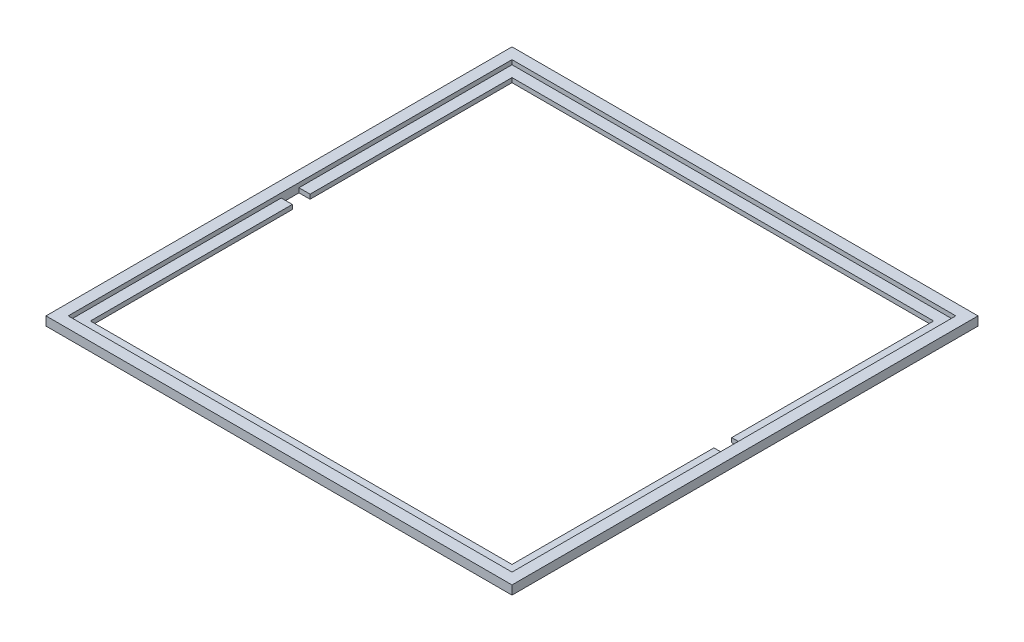
ISO-10303-21;
HEADER;
FILE_DESCRIPTION(('STEP AP214'),'2;1');
FILE_NAME('part.step','',(''),(''),'','','');
FILE_SCHEMA(('AUTOMOTIVE_DESIGN { 1 0 10303 214 1 1 1 1 }'));
ENDSEC;
DATA;
#1=APPLICATION_CONTEXT('core data for automotive mechanical design processes');
#2=APPLICATION_PROTOCOL_DEFINITION('international standard','automotive_design',2000,#1);
#3=PRODUCT_CONTEXT('',#1,'mechanical');
#4=PRODUCT('Part','Part','',(#3));
#5=PRODUCT_RELATED_PRODUCT_CATEGORY('part','',(#4));
#6=PRODUCT_DEFINITION_FORMATION('','',#4);
#7=PRODUCT_DEFINITION_CONTEXT('part definition',#1,'design');
#8=PRODUCT_DEFINITION('design','',#6,#7);
#9=PRODUCT_DEFINITION_SHAPE('','',#8);
#10=(LENGTH_UNIT() NAMED_UNIT(*) SI_UNIT(.MILLI.,.METRE.));
#11=(NAMED_UNIT(*) PLANE_ANGLE_UNIT() SI_UNIT($,.RADIAN.));
#12=(NAMED_UNIT(*) SI_UNIT($,.STERADIAN.) SOLID_ANGLE_UNIT());
#13=UNCERTAINTY_MEASURE_WITH_UNIT(LENGTH_MEASURE(1.E-05),#10,'distance_accuracy_value','');
#14=(GEOMETRIC_REPRESENTATION_CONTEXT(3) GLOBAL_UNCERTAINTY_ASSIGNED_CONTEXT((#13)) GLOBAL_UNIT_ASSIGNED_CONTEXT((#10,
#11,#12)) REPRESENTATION_CONTEXT('',''));
#15=CARTESIAN_POINT('',(0.,0.,0.));
#16=DIRECTION('',(0.,0.,1.));
#17=DIRECTION('',(1.,0.,0.));
#18=AXIS2_PLACEMENT_3D('',#15,#16,#17);
#19=CARTESIAN_POINT('',(0.,2.,0.));
#20=DIRECTION('',(0.,1.,0.));
#21=DIRECTION('',(0.,0.,1.));
#22=AXIS2_PLACEMENT_3D('',#19,#20,#21);
#23=PLANE('',#22);
#24=DIRECTION('',(0.,0.,1.));
#25=VECTOR('',#24,1.);
#26=CARTESIAN_POINT('',(200.,2.,0.));
#27=LINE('',#26,#25);
#28=CARTESIAN_POINT('',(200.,2.,-96.));
#29=VERTEX_POINT('',#28);
#30=CARTESIAN_POINT('',(200.,2.,0.));
#31=VERTEX_POINT('',#30);
#32=EDGE_CURVE('E328',#29,#31,#27,.T.);
#33=ORIENTED_EDGE('',*,*,#32,.F.);
#34=DIRECTION('',(-1.,0.,0.));
#35=VECTOR('',#34,1.);
#36=CARTESIAN_POINT('',(0.,2.,-96.));
#37=LINE('',#36,#35);
#38=CARTESIAN_POINT('',(195.,2.,-96.));
#39=VERTEX_POINT('',#38);
#40=EDGE_CURVE('E134',#29,#39,#37,.T.);
#41=ORIENTED_EDGE('',*,*,#40,.T.);
#42=DIRECTION('',(0.,0.,-1.));
#43=VECTOR('',#42,1.);
#44=CARTESIAN_POINT('',(195.,2.,0.));
#45=LINE('',#44,#43);
#46=CARTESIAN_POINT('',(195.,2.,-5.));
#47=VERTEX_POINT('',#46);
#48=EDGE_CURVE('E343',#47,#39,#45,.T.);
#49=ORIENTED_EDGE('',*,*,#48,.F.);
#50=DIRECTION('',(1.,0.,0.));
#51=VECTOR('',#50,1.);
#52=CARTESIAN_POINT('',(0.,2.,-5.));
#53=LINE('',#52,#51);
#54=CARTESIAN_POINT('',(5.,2.,-5.));
#55=VERTEX_POINT('',#54);
#56=EDGE_CURVE('E346',#55,#47,#53,.T.);
#57=ORIENTED_EDGE('',*,*,#56,.F.);
#58=DIRECTION('',(0.,0.,-1.));
#59=VECTOR('',#58,1.);
#60=CARTESIAN_POINT('',(5.,2.,0.));
#61=LINE('',#60,#59);
#62=CARTESIAN_POINT('',(5.,2.,-96.));
#63=VERTEX_POINT('',#62);
#64=EDGE_CURVE('E350',#55,#63,#61,.T.);
#65=ORIENTED_EDGE('',*,*,#64,.T.);
#66=DIRECTION('',(1.,0.,0.));
#67=VECTOR('',#66,1.);
#68=CARTESIAN_POINT('',(0.,2.,-96.));
#69=LINE('',#68,#67);
#70=CARTESIAN_POINT('',(0.,2.,-96.));
#71=VERTEX_POINT('',#70);
#72=EDGE_CURVE('E353',#71,#63,#69,.T.);
#73=ORIENTED_EDGE('',*,*,#72,.F.);
#74=DIRECTION('',(0.,0.,1.));
#75=VECTOR('',#74,1.);
#76=CARTESIAN_POINT('',(0.,2.,0.));
#77=LINE('',#76,#75);
#78=CARTESIAN_POINT('',(0.,2.,0.));
#79=VERTEX_POINT('',#78);
#80=EDGE_CURVE('E362',#71,#79,#77,.T.);
#81=ORIENTED_EDGE('',*,*,#80,.T.);
#82=DIRECTION('',(-1.,0.,0.));
#83=VECTOR('',#82,1.);
#84=CARTESIAN_POINT('',(0.,2.,0.));
#85=LINE('',#84,#83);
#86=EDGE_CURVE('E331',#31,#79,#85,.T.);
#87=ORIENTED_EDGE('',*,*,#86,.F.);
#88=EDGE_LOOP('',(#33,#41,#49,#57,#65,#73,#81,#87));
#89=FACE_BOUND('',#88,.T.);
#90=ADVANCED_FACE('F41',(#89),#23,.T.);
#91=CARTESIAN_POINT('',(-5.,2.,0.));
#92=DIRECTION('',(-1.,0.,0.));
#93=DIRECTION('',(0.,0.,1.));
#94=AXIS2_PLACEMENT_3D('',#91,#92,#93);
#95=PLANE('',#94);
#96=DIRECTION('',(0.,0.,-1.));
#97=VECTOR('',#96,1.);
#98=CARTESIAN_POINT('',(-5.,0.,0.));
#99=LINE('',#98,#97);
#100=CARTESIAN_POINT('',(-5.,0.,5.));
#101=VERTEX_POINT('',#100);
#102=CARTESIAN_POINT('',(-5.,0.,-205.));
#103=VERTEX_POINT('',#102);
#104=EDGE_CURVE('E236',#101,#103,#99,.T.);
#105=ORIENTED_EDGE('',*,*,#104,.F.);
#106=DIRECTION('',(0.,-1.,0.));
#107=VECTOR('',#106,1.);
#108=CARTESIAN_POINT('',(-5.,2.,5.));
#109=LINE('',#108,#107);
#110=CARTESIAN_POINT('',(-5.,4.,5.));
#111=VERTEX_POINT('',#110);
#112=EDGE_CURVE('E11',#111,#101,#109,.T.);
#113=ORIENTED_EDGE('',*,*,#112,.F.);
#114=DIRECTION('',(0.,0.,-1.));
#115=VECTOR('',#114,1.);
#116=CARTESIAN_POINT('',(-5.,4.,0.));
#117=LINE('',#116,#115);
#118=CARTESIAN_POINT('',(-5.,4.,-205.));
#119=VERTEX_POINT('',#118);
#120=EDGE_CURVE('E519',#111,#119,#117,.T.);
#121=ORIENTED_EDGE('',*,*,#120,.T.);
#122=DIRECTION('',(0.,-1.,0.));
#123=VECTOR('',#122,1.);
#124=CARTESIAN_POINT('',(-5.,2.,-205.));
#125=LINE('',#124,#123);
#126=EDGE_CURVE('E125',#119,#103,#125,.T.);
#127=ORIENTED_EDGE('',*,*,#126,.T.);
#128=EDGE_LOOP('',(#105,#113,#121,#127));
#129=FACE_BOUND('',#128,.T.);
#130=ADVANCED_FACE('F380',(#129),#95,.T.);
#131=CARTESIAN_POINT('',(0.,2.,5.));
#132=DIRECTION('',(0.,0.,-1.));
#133=DIRECTION('',(-1.,0.,0.));
#134=AXIS2_PLACEMENT_3D('',#131,#132,#133);
#135=PLANE('',#134);
#136=DIRECTION('',(1.,0.,0.));
#137=VECTOR('',#136,1.);
#138=CARTESIAN_POINT('',(0.,0.,5.));
#139=LINE('',#138,#137);
#140=CARTESIAN_POINT('',(205.,0.,5.));
#141=VERTEX_POINT('',#140);
#142=EDGE_CURVE('E239',#101,#141,#139,.T.);
#143=ORIENTED_EDGE('',*,*,#142,.T.);
#144=DIRECTION('',(0.,-1.,0.));
#145=VECTOR('',#144,1.);
#146=CARTESIAN_POINT('',(205.,2.,5.));
#147=LINE('',#146,#145);
#148=CARTESIAN_POINT('',(205.,4.,5.));
#149=VERTEX_POINT('',#148);
#150=EDGE_CURVE('E51',#149,#141,#147,.T.);
#151=ORIENTED_EDGE('',*,*,#150,.F.);
#152=DIRECTION('',(1.,0.,0.));
#153=VECTOR('',#152,1.);
#154=CARTESIAN_POINT('',(0.,4.,5.));
#155=LINE('',#154,#153);
#156=EDGE_CURVE('E523',#111,#149,#155,.T.);
#157=ORIENTED_EDGE('',*,*,#156,.F.);
#158=ORIENTED_EDGE('',*,*,#112,.T.);
#159=EDGE_LOOP('',(#143,#151,#157,#158));
#160=FACE_BOUND('',#159,.T.);
#161=ADVANCED_FACE('F385',(#160),#135,.F.);
#162=CARTESIAN_POINT('',(205.,2.,0.));
#163=DIRECTION('',(-1.,0.,0.));
#164=DIRECTION('',(0.,0.,1.));
#165=AXIS2_PLACEMENT_3D('',#162,#163,#164);
#166=PLANE('',#165);
#167=DIRECTION('',(0.,0.,-1.));
#168=VECTOR('',#167,1.);
#169=CARTESIAN_POINT('',(205.,0.,0.));
#170=LINE('',#169,#168);
#171=CARTESIAN_POINT('',(205.,0.,-205.));
#172=VERTEX_POINT('',#171);
#173=EDGE_CURVE('E243',#141,#172,#170,.T.);
#174=ORIENTED_EDGE('',*,*,#173,.T.);
#175=DIRECTION('',(0.,-1.,0.));
#176=VECTOR('',#175,1.);
#177=CARTESIAN_POINT('',(205.,2.,-205.));
#178=LINE('',#177,#176);
#179=CARTESIAN_POINT('',(205.,4.,-205.));
#180=VERTEX_POINT('',#179);
#181=EDGE_CURVE('E253',#180,#172,#178,.T.);
#182=ORIENTED_EDGE('',*,*,#181,.F.);
#183=DIRECTION('',(0.,0.,-1.));
#184=VECTOR('',#183,1.);
#185=CARTESIAN_POINT('',(205.,4.,0.));
#186=LINE('',#185,#184);
#187=EDGE_CURVE('E535',#149,#180,#186,.T.);
#188=ORIENTED_EDGE('',*,*,#187,.F.);
#189=ORIENTED_EDGE('',*,*,#150,.T.);
#190=EDGE_LOOP('',(#174,#182,#188,#189));
#191=FACE_BOUND('',#190,.T.);
#192=ADVANCED_FACE('F404',(#191),#166,.F.);
#193=CARTESIAN_POINT('',(200.,2.,0.));
#194=DIRECTION('',(-1.,0.,0.));
#195=DIRECTION('',(0.,0.,1.));
#196=AXIS2_PLACEMENT_3D('',#193,#194,#195);
#197=PLANE('',#196);
#198=DIRECTION('',(0.,0.,-1.));
#199=VECTOR('',#198,1.);
#200=CARTESIAN_POINT('',(200.,0.,0.));
#201=LINE('',#200,#199);
#202=CARTESIAN_POINT('',(200.,0.,-96.));
#203=VERTEX_POINT('',#202);
#204=CARTESIAN_POINT('',(200.,0.,-104.));
#205=VERTEX_POINT('',#204);
#206=EDGE_CURVE('E192',#203,#205,#201,.T.);
#207=ORIENTED_EDGE('',*,*,#206,.F.);
#208=DIRECTION('',(0.,-1.,0.));
#209=VECTOR('',#208,1.);
#210=CARTESIAN_POINT('',(200.,2.,-96.));
#211=LINE('',#210,#209);
#212=EDGE_CURVE('E45',#29,#203,#211,.T.);
#213=ORIENTED_EDGE('',*,*,#212,.F.);
#214=ORIENTED_EDGE('',*,*,#32,.T.);
#215=DIRECTION('',(0.,-1.,0.));
#216=VECTOR('',#215,1.);
#217=CARTESIAN_POINT('',(200.,4.,0.));
#218=LINE('',#217,#216);
#219=CARTESIAN_POINT('',(200.,4.,0.));
#220=VERTEX_POINT('',#219);
#221=EDGE_CURVE('E554',#220,#31,#218,.T.);
#222=ORIENTED_EDGE('',*,*,#221,.F.);
#223=DIRECTION('',(0.,0.,-1.));
#224=VECTOR('',#223,1.);
#225=CARTESIAN_POINT('',(200.,4.,0.));
#226=LINE('',#225,#224);
#227=CARTESIAN_POINT('',(200.,4.,-200.));
#228=VERTEX_POINT('',#227);
#229=EDGE_CURVE('E513',#220,#228,#226,.T.);
#230=ORIENTED_EDGE('',*,*,#229,.T.);
#231=DIRECTION('',(0.,-1.,0.));
#232=VECTOR('',#231,1.);
#233=CARTESIAN_POINT('',(200.,4.,-200.));
#234=LINE('',#233,#232);
#235=CARTESIAN_POINT('',(200.,2.,-200.));
#236=VERTEX_POINT('',#235);
#237=EDGE_CURVE('E545',#228,#236,#234,.T.);
#238=ORIENTED_EDGE('',*,*,#237,.T.);
#239=CARTESIAN_POINT('',(200.,2.,-104.));
#240=VERTEX_POINT('',#239);
#241=EDGE_CURVE('E197',#236,#240,#27,.T.);
#242=ORIENTED_EDGE('',*,*,#241,.T.);
#243=DIRECTION('',(0.,-1.,0.));
#244=VECTOR('',#243,1.);
#245=CARTESIAN_POINT('',(200.,2.,-104.));
#246=LINE('',#245,#244);
#247=EDGE_CURVE('E191',#240,#205,#246,.T.);
#248=ORIENTED_EDGE('',*,*,#247,.T.);
#249=EDGE_LOOP('',(#207,#213,#214,#222,#230,#238,#242,#248));
#250=FACE_BOUND('',#249,.T.);
#251=ADVANCED_FACE('F43',(#250),#197,.T.);
#252=CARTESIAN_POINT('',(0.,2.,-96.));
#253=DIRECTION('',(0.,0.,1.));
#254=DIRECTION('',(1.,0.,0.));
#255=AXIS2_PLACEMENT_3D('',#252,#253,#254);
#256=PLANE('',#255);
#257=DIRECTION('',(-1.,0.,0.));
#258=VECTOR('',#257,1.);
#259=CARTESIAN_POINT('',(0.,0.,-96.));
#260=LINE('',#259,#258);
#261=CARTESIAN_POINT('',(195.,0.,-96.));
#262=VERTEX_POINT('',#261);
#263=EDGE_CURVE('E196',#203,#262,#260,.T.);
#264=ORIENTED_EDGE('',*,*,#263,.T.);
#265=DIRECTION('',(0.,-1.,0.));
#266=VECTOR('',#265,1.);
#267=CARTESIAN_POINT('',(195.,2.,-96.));
#268=LINE('',#267,#266);
#269=EDGE_CURVE('E282',#39,#262,#268,.T.);
#270=ORIENTED_EDGE('',*,*,#269,.F.);
#271=ORIENTED_EDGE('',*,*,#40,.F.);
#272=ORIENTED_EDGE('',*,*,#212,.T.);
#273=EDGE_LOOP('',(#264,#270,#271,#272));
#274=FACE_BOUND('',#273,.T.);
#275=ADVANCED_FACE('F291',(#274),#256,.F.);
#276=CARTESIAN_POINT('',(195.,2.,0.));
#277=DIRECTION('',(-1.,0.,0.));
#278=DIRECTION('',(0.,0.,1.));
#279=AXIS2_PLACEMENT_3D('',#276,#277,#278);
#280=PLANE('',#279);
#281=DIRECTION('',(0.,0.,-1.));
#282=VECTOR('',#281,1.);
#283=CARTESIAN_POINT('',(195.,0.,0.));
#284=LINE('',#283,#282);
#285=CARTESIAN_POINT('',(195.,0.,-5.));
#286=VERTEX_POINT('',#285);
#287=EDGE_CURVE('E201',#286,#262,#284,.T.);
#288=ORIENTED_EDGE('',*,*,#287,.F.);
#289=DIRECTION('',(0.,-1.,0.));
#290=VECTOR('',#289,1.);
#291=CARTESIAN_POINT('',(195.,2.,-5.));
#292=LINE('',#291,#290);
#293=EDGE_CURVE('E280',#47,#286,#292,.T.);
#294=ORIENTED_EDGE('',*,*,#293,.F.);
#295=ORIENTED_EDGE('',*,*,#48,.T.);
#296=ORIENTED_EDGE('',*,*,#269,.T.);
#297=EDGE_LOOP('',(#288,#294,#295,#296));
#298=FACE_BOUND('',#297,.T.);
#299=ADVANCED_FACE('F371',(#298),#280,.T.);
#300=CARTESIAN_POINT('',(0.,2.,-5.));
#301=DIRECTION('',(0.,0.,-1.));
#302=DIRECTION('',(-1.,0.,0.));
#303=AXIS2_PLACEMENT_3D('',#300,#301,#302);
#304=PLANE('',#303);
#305=DIRECTION('',(1.,0.,0.));
#306=VECTOR('',#305,1.);
#307=CARTESIAN_POINT('',(0.,0.,-5.));
#308=LINE('',#307,#306);
#309=CARTESIAN_POINT('',(5.,0.,-5.));
#310=VERTEX_POINT('',#309);
#311=EDGE_CURVE('E205',#310,#286,#308,.T.);
#312=ORIENTED_EDGE('',*,*,#311,.F.);
#313=DIRECTION('',(0.,-1.,0.));
#314=VECTOR('',#313,1.);
#315=CARTESIAN_POINT('',(5.,2.,-5.));
#316=LINE('',#315,#314);
#317=EDGE_CURVE('E277',#55,#310,#316,.T.);
#318=ORIENTED_EDGE('',*,*,#317,.F.);
#319=ORIENTED_EDGE('',*,*,#56,.T.);
#320=ORIENTED_EDGE('',*,*,#293,.T.);
#321=EDGE_LOOP('',(#312,#318,#319,#320));
#322=FACE_BOUND('',#321,.T.);
#323=ADVANCED_FACE('F370',(#322),#304,.T.);
#324=CARTESIAN_POINT('',(5.,2.,0.));
#325=DIRECTION('',(-1.,0.,0.));
#326=DIRECTION('',(0.,0.,1.));
#327=AXIS2_PLACEMENT_3D('',#324,#325,#326);
#328=PLANE('',#327);
#329=DIRECTION('',(0.,0.,-1.));
#330=VECTOR('',#329,1.);
#331=CARTESIAN_POINT('',(5.,0.,0.));
#332=LINE('',#331,#330);
#333=CARTESIAN_POINT('',(5.,0.,-96.));
#334=VERTEX_POINT('',#333);
#335=EDGE_CURVE('E209',#310,#334,#332,.T.);
#336=ORIENTED_EDGE('',*,*,#335,.T.);
#337=DIRECTION('',(0.,-1.,0.));
#338=VECTOR('',#337,1.);
#339=CARTESIAN_POINT('',(5.,2.,-96.));
#340=LINE('',#339,#338);
#341=EDGE_CURVE('E274',#63,#334,#340,.T.);
#342=ORIENTED_EDGE('',*,*,#341,.F.);
#343=ORIENTED_EDGE('',*,*,#64,.F.);
#344=ORIENTED_EDGE('',*,*,#317,.T.);
#345=EDGE_LOOP('',(#336,#342,#343,#344));
#346=FACE_BOUND('',#345,.T.);
#347=ADVANCED_FACE('F366',(#346),#328,.F.);
#348=CARTESIAN_POINT('',(0.,2.,-96.));
#349=DIRECTION('',(0.,0.,-1.));
#350=DIRECTION('',(-1.,0.,0.));
#351=AXIS2_PLACEMENT_3D('',#348,#349,#350);
#352=PLANE('',#351);
#353=DIRECTION('',(1.,0.,0.));
#354=VECTOR('',#353,1.);
#355=CARTESIAN_POINT('',(0.,0.,-96.));
#356=LINE('',#355,#354);
#357=CARTESIAN_POINT('',(0.,0.,-96.));
#358=VERTEX_POINT('',#357);
#359=EDGE_CURVE('E213',#358,#334,#356,.T.);
#360=ORIENTED_EDGE('',*,*,#359,.F.);
#361=DIRECTION('',(0.,-1.,0.));
#362=VECTOR('',#361,1.);
#363=CARTESIAN_POINT('',(0.,2.,-96.));
#364=LINE('',#363,#362);
#365=EDGE_CURVE('E271',#71,#358,#364,.T.);
#366=ORIENTED_EDGE('',*,*,#365,.F.);
#367=ORIENTED_EDGE('',*,*,#72,.T.);
#368=ORIENTED_EDGE('',*,*,#341,.T.);
#369=EDGE_LOOP('',(#360,#366,#367,#368));
#370=FACE_BOUND('',#369,.T.);
#371=ADVANCED_FACE('F360',(#370),#352,.T.);
#372=CARTESIAN_POINT('',(0.,2.,0.));
#373=DIRECTION('',(-1.,0.,0.));
#374=DIRECTION('',(0.,0.,1.));
#375=AXIS2_PLACEMENT_3D('',#372,#373,#374);
#376=PLANE('',#375);
#377=DIRECTION('',(0.,0.,-1.));
#378=VECTOR('',#377,1.);
#379=CARTESIAN_POINT('',(0.,0.,0.));
#380=LINE('',#379,#378);
#381=CARTESIAN_POINT('',(0.,0.,-104.));
#382=VERTEX_POINT('',#381);
#383=EDGE_CURVE('E217',#358,#382,#380,.T.);
#384=ORIENTED_EDGE('',*,*,#383,.T.);
#385=DIRECTION('',(0.,-1.,0.));
#386=VECTOR('',#385,1.);
#387=CARTESIAN_POINT('',(0.,2.,-104.));
#388=LINE('',#387,#386);
#389=CARTESIAN_POINT('',(0.,2.,-104.));
#390=VERTEX_POINT('',#389);
#391=EDGE_CURVE('E267',#390,#382,#388,.T.);
#392=ORIENTED_EDGE('',*,*,#391,.F.);
#393=CARTESIAN_POINT('',(0.,2.,-200.));
#394=VERTEX_POINT('',#393);
#395=EDGE_CURVE('E318',#394,#390,#77,.T.);
#396=ORIENTED_EDGE('',*,*,#395,.F.);
#397=DIRECTION('',(0.,-1.,0.));
#398=VECTOR('',#397,1.);
#399=CARTESIAN_POINT('',(0.,4.,-200.));
#400=LINE('',#399,#398);
#401=CARTESIAN_POINT('',(0.,4.,-200.));
#402=VERTEX_POINT('',#401);
#403=EDGE_CURVE('E59',#402,#394,#400,.T.);
#404=ORIENTED_EDGE('',*,*,#403,.F.);
#405=DIRECTION('',(0.,0.,-1.));
#406=VECTOR('',#405,1.);
#407=CARTESIAN_POINT('',(0.,4.,0.));
#408=LINE('',#407,#406);
#409=CARTESIAN_POINT('',(0.,4.,0.));
#410=VERTEX_POINT('',#409);
#411=EDGE_CURVE('E537',#410,#402,#408,.T.);
#412=ORIENTED_EDGE('',*,*,#411,.F.);
#413=DIRECTION('',(0.,-1.,0.));
#414=VECTOR('',#413,1.);
#415=CARTESIAN_POINT('',(0.,4.,0.));
#416=LINE('',#415,#414);
#417=EDGE_CURVE('E550',#410,#79,#416,.T.);
#418=ORIENTED_EDGE('',*,*,#417,.T.);
#419=ORIENTED_EDGE('',*,*,#80,.F.);
#420=ORIENTED_EDGE('',*,*,#365,.T.);
#421=EDGE_LOOP('',(#384,#392,#396,#404,#412,#418,#419,#420));
#422=FACE_BOUND('',#421,.T.);
#423=ADVANCED_FACE('F317',(#422),#376,.F.);
#424=CARTESIAN_POINT('',(0.,2.,-104.));
#425=DIRECTION('',(0.,0.,-1.));
#426=DIRECTION('',(-1.,0.,0.));
#427=AXIS2_PLACEMENT_3D('',#424,#425,#426);
#428=PLANE('',#427);
#429=DIRECTION('',(1.,0.,0.));
#430=VECTOR('',#429,1.);
#431=CARTESIAN_POINT('',(0.,0.,-104.));
#432=LINE('',#431,#430);
#433=CARTESIAN_POINT('',(5.,0.,-104.));
#434=VERTEX_POINT('',#433);
#435=EDGE_CURVE('E220',#382,#434,#432,.T.);
#436=ORIENTED_EDGE('',*,*,#435,.T.);
#437=DIRECTION('',(0.,-1.,0.));
#438=VECTOR('',#437,1.);
#439=CARTESIAN_POINT('',(5.,2.,-104.));
#440=LINE('',#439,#438);
#441=CARTESIAN_POINT('',(5.,2.,-104.));
#442=VERTEX_POINT('',#441);
#443=EDGE_CURVE('E176',#442,#434,#440,.T.);
#444=ORIENTED_EDGE('',*,*,#443,.F.);
#445=DIRECTION('',(1.,0.,0.));
#446=VECTOR('',#445,1.);
#447=CARTESIAN_POINT('',(0.,2.,-104.));
#448=LINE('',#447,#446);
#449=EDGE_CURVE('E161',#390,#442,#448,.T.);
#450=ORIENTED_EDGE('',*,*,#449,.F.);
#451=ORIENTED_EDGE('',*,*,#391,.T.);
#452=EDGE_LOOP('',(#436,#444,#450,#451));
#453=FACE_BOUND('',#452,.T.);
#454=ADVANCED_FACE('F313',(#453),#428,.F.);
#455=CARTESIAN_POINT('',(4.99999999999999,2.,0.));
#456=DIRECTION('',(-1.,0.,0.));
#457=DIRECTION('',(0.,0.,1.));
#458=AXIS2_PLACEMENT_3D('',#455,#456,#457);
#459=PLANE('',#458);
#460=DIRECTION('',(0.,0.,-1.));
#461=VECTOR('',#460,1.);
#462=CARTESIAN_POINT('',(4.99999999999999,0.,0.));
#463=LINE('',#462,#461);
#464=CARTESIAN_POINT('',(5.,0.,-195.));
#465=VERTEX_POINT('',#464);
#466=EDGE_CURVE('E171',#434,#465,#463,.T.);
#467=ORIENTED_EDGE('',*,*,#466,.T.);
#468=DIRECTION('',(0.,-1.,0.));
#469=VECTOR('',#468,1.);
#470=CARTESIAN_POINT('',(5.,2.,-195.));
#471=LINE('',#470,#469);
#472=CARTESIAN_POINT('',(5.,2.,-195.));
#473=VERTEX_POINT('',#472);
#474=EDGE_CURVE('E168',#473,#465,#471,.T.);
#475=ORIENTED_EDGE('',*,*,#474,.F.);
#476=DIRECTION('',(0.,0.,-1.));
#477=VECTOR('',#476,1.);
#478=CARTESIAN_POINT('',(4.99999999999999,2.,0.));
#479=LINE('',#478,#477);
#480=EDGE_CURVE('E152',#442,#473,#479,.T.);
#481=ORIENTED_EDGE('',*,*,#480,.F.);
#482=ORIENTED_EDGE('',*,*,#443,.T.);
#483=EDGE_LOOP('',(#467,#475,#481,#482));
#484=FACE_BOUND('',#483,.T.);
#485=ADVANCED_FACE('F169',(#484),#459,.F.);
#486=CARTESIAN_POINT('',(0.,2.,-195.));
#487=DIRECTION('',(0.,0.,-1.));
#488=DIRECTION('',(-1.,0.,0.));
#489=AXIS2_PLACEMENT_3D('',#486,#487,#488);
#490=PLANE('',#489);
#491=DIRECTION('',(1.,0.,0.));
#492=VECTOR('',#491,1.);
#493=CARTESIAN_POINT('',(0.,0.,-195.));
#494=LINE('',#493,#492);
#495=CARTESIAN_POINT('',(195.,0.,-195.));
#496=VERTEX_POINT('',#495);
#497=EDGE_CURVE('E225',#465,#496,#494,.T.);
#498=ORIENTED_EDGE('',*,*,#497,.T.);
#499=DIRECTION('',(0.,-1.,0.));
#500=VECTOR('',#499,1.);
#501=CARTESIAN_POINT('',(195.,2.,-195.));
#502=LINE('',#501,#500);
#503=CARTESIAN_POINT('',(195.,2.,-195.));
#504=VERTEX_POINT('',#503);
#505=EDGE_CURVE('E177',#504,#496,#502,.T.);
#506=ORIENTED_EDGE('',*,*,#505,.F.);
#507=DIRECTION('',(1.,0.,0.));
#508=VECTOR('',#507,1.);
#509=CARTESIAN_POINT('',(0.,2.,-195.));
#510=LINE('',#509,#508);
#511=EDGE_CURVE('E157',#473,#504,#510,.T.);
#512=ORIENTED_EDGE('',*,*,#511,.F.);
#513=ORIENTED_EDGE('',*,*,#474,.T.);
#514=EDGE_LOOP('',(#498,#506,#512,#513));
#515=FACE_BOUND('',#514,.T.);
#516=ADVANCED_FACE('F179',(#515),#490,.F.);
#517=CARTESIAN_POINT('',(195.,2.,0.));
#518=DIRECTION('',(-1.,0.,0.));
#519=DIRECTION('',(0.,0.,1.));
#520=AXIS2_PLACEMENT_3D('',#517,#518,#519);
#521=PLANE('',#520);
#522=DIRECTION('',(0.,0.,-1.));
#523=VECTOR('',#522,1.);
#524=CARTESIAN_POINT('',(195.,0.,0.));
#525=LINE('',#524,#523);
#526=CARTESIAN_POINT('',(195.,0.,-104.));
#527=VERTEX_POINT('',#526);
#528=EDGE_CURVE('E228',#527,#496,#525,.T.);
#529=ORIENTED_EDGE('',*,*,#528,.F.);
#530=DIRECTION('',(0.,-1.,0.));
#531=VECTOR('',#530,1.);
#532=CARTESIAN_POINT('',(195.,2.,-104.));
#533=LINE('',#532,#531);
#534=CARTESIAN_POINT('',(195.,2.,-104.));
#535=VERTEX_POINT('',#534);
#536=EDGE_CURVE('E68',#535,#527,#533,.T.);
#537=ORIENTED_EDGE('',*,*,#536,.F.);
#538=DIRECTION('',(0.,0.,-1.));
#539=VECTOR('',#538,1.);
#540=CARTESIAN_POINT('',(195.,2.,0.));
#541=LINE('',#540,#539);
#542=EDGE_CURVE('E181',#535,#504,#541,.T.);
#543=ORIENTED_EDGE('',*,*,#542,.T.);
#544=ORIENTED_EDGE('',*,*,#505,.T.);
#545=EDGE_LOOP('',(#529,#537,#543,#544));
#546=FACE_BOUND('',#545,.T.);
#547=ADVANCED_FACE('F308',(#546),#521,.T.);
#548=CARTESIAN_POINT('',(0.,2.,-104.));
#549=DIRECTION('',(0.,0.,1.));
#550=DIRECTION('',(1.,0.,0.));
#551=AXIS2_PLACEMENT_3D('',#548,#549,#550);
#552=PLANE('',#551);
#553=DIRECTION('',(-1.,0.,0.));
#554=VECTOR('',#553,1.);
#555=CARTESIAN_POINT('',(0.,0.,-104.));
#556=LINE('',#555,#554);
#557=EDGE_CURVE('E232',#205,#527,#556,.T.);
#558=ORIENTED_EDGE('',*,*,#557,.F.);
#559=ORIENTED_EDGE('',*,*,#247,.F.);
#560=DIRECTION('',(-1.,0.,0.));
#561=VECTOR('',#560,1.);
#562=CARTESIAN_POINT('',(0.,2.,-104.));
#563=LINE('',#562,#561);
#564=EDGE_CURVE('E184',#240,#535,#563,.T.);
#565=ORIENTED_EDGE('',*,*,#564,.T.);
#566=ORIENTED_EDGE('',*,*,#536,.T.);
#567=EDGE_LOOP('',(#558,#559,#565,#566));
#568=FACE_BOUND('',#567,.T.);
#569=ADVANCED_FACE('F305',(#568),#552,.T.);
#570=CARTESIAN_POINT('',(0.,2.,-205.));
#571=DIRECTION('',(0.,0.,-1.));
#572=DIRECTION('',(-1.,0.,0.));
#573=AXIS2_PLACEMENT_3D('',#570,#571,#572);
#574=PLANE('',#573);
#575=DIRECTION('',(1.,0.,0.));
#576=VECTOR('',#575,1.);
#577=CARTESIAN_POINT('',(0.,0.,-205.));
#578=LINE('',#577,#576);
#579=EDGE_CURVE('E247',#103,#172,#578,.T.);
#580=ORIENTED_EDGE('',*,*,#579,.F.);
#581=ORIENTED_EDGE('',*,*,#126,.F.);
#582=DIRECTION('',(1.,0.,0.));
#583=VECTOR('',#582,1.);
#584=CARTESIAN_POINT('',(0.,4.,-205.));
#585=LINE('',#584,#583);
#586=EDGE_CURVE('E526',#119,#180,#585,.T.);
#587=ORIENTED_EDGE('',*,*,#586,.T.);
#588=ORIENTED_EDGE('',*,*,#181,.T.);
#589=EDGE_LOOP('',(#580,#581,#587,#588));
#590=FACE_BOUND('',#589,.T.);
#591=ADVANCED_FACE('F390',(#590),#574,.T.);
#592=ORIENTED_EDGE('',*,*,#241,.F.);
#593=DIRECTION('',(-1.,0.,0.));
#594=VECTOR('',#593,1.);
#595=CARTESIAN_POINT('',(0.,2.,-200.));
#596=LINE('',#595,#594);
#597=EDGE_CURVE('E557',#236,#394,#596,.T.);
#598=ORIENTED_EDGE('',*,*,#597,.T.);
#599=ORIENTED_EDGE('',*,*,#395,.T.);
#600=ORIENTED_EDGE('',*,*,#449,.T.);
#601=ORIENTED_EDGE('',*,*,#480,.T.);
#602=ORIENTED_EDGE('',*,*,#511,.T.);
#603=ORIENTED_EDGE('',*,*,#542,.F.);
#604=ORIENTED_EDGE('',*,*,#564,.F.);
#605=EDGE_LOOP('',(#592,#598,#599,#600,#601,#602,#603,#604));
#606=FACE_BOUND('',#605,.T.);
#607=ADVANCED_FACE('F155',(#606),#23,.T.);
#608=CARTESIAN_POINT('',(0.,0.,0.));
#609=DIRECTION('',(0.,1.,0.));
#610=DIRECTION('',(0.,0.,1.));
#611=AXIS2_PLACEMENT_3D('',#608,#609,#610);
#612=PLANE('',#611);
#613=ORIENTED_EDGE('',*,*,#206,.T.);
#614=ORIENTED_EDGE('',*,*,#557,.T.);
#615=ORIENTED_EDGE('',*,*,#528,.T.);
#616=ORIENTED_EDGE('',*,*,#497,.F.);
#617=ORIENTED_EDGE('',*,*,#466,.F.);
#618=ORIENTED_EDGE('',*,*,#435,.F.);
#619=ORIENTED_EDGE('',*,*,#383,.F.);
#620=ORIENTED_EDGE('',*,*,#359,.T.);
#621=ORIENTED_EDGE('',*,*,#335,.F.);
#622=ORIENTED_EDGE('',*,*,#311,.T.);
#623=ORIENTED_EDGE('',*,*,#287,.T.);
#624=ORIENTED_EDGE('',*,*,#263,.F.);
#625=EDGE_LOOP('',(#613,#614,#615,#616,#617,#618,#619,#620,#621,#622,#623,#624));
#626=FACE_BOUND('',#625,.T.);
#627=ORIENTED_EDGE('',*,*,#104,.T.);
#628=ORIENTED_EDGE('',*,*,#579,.T.);
#629=ORIENTED_EDGE('',*,*,#173,.F.);
#630=ORIENTED_EDGE('',*,*,#142,.F.);
#631=EDGE_LOOP('',(#627,#628,#629,#630));
#632=FACE_BOUND('',#631,.T.);
#633=ADVANCED_FACE('F297',(#626,#632),#612,.F.);
#634=CARTESIAN_POINT('',(0.,4.,0.));
#635=DIRECTION('',(0.,0.,-1.));
#636=DIRECTION('',(-1.,0.,0.));
#637=AXIS2_PLACEMENT_3D('',#634,#635,#636);
#638=PLANE('',#637);
#639=ORIENTED_EDGE('',*,*,#221,.T.);
#640=ORIENTED_EDGE('',*,*,#86,.T.);
#641=ORIENTED_EDGE('',*,*,#417,.F.);
#642=DIRECTION('',(1.,0.,0.));
#643=VECTOR('',#642,1.);
#644=CARTESIAN_POINT('',(0.,4.,0.));
#645=LINE('',#644,#643);
#646=EDGE_CURVE('E566',#410,#220,#645,.T.);
#647=ORIENTED_EDGE('',*,*,#646,.T.);
#648=EDGE_LOOP('',(#639,#640,#641,#647));
#649=FACE_BOUND('',#648,.T.);
#650=ADVANCED_FACE('F395',(#649),#638,.T.);
#651=CARTESIAN_POINT('',(0.,4.,-200.));
#652=DIRECTION('',(0.,0.,-1.));
#653=DIRECTION('',(-1.,0.,0.));
#654=AXIS2_PLACEMENT_3D('',#651,#652,#653);
#655=PLANE('',#654);
#656=ORIENTED_EDGE('',*,*,#597,.F.);
#657=ORIENTED_EDGE('',*,*,#237,.F.);
#658=DIRECTION('',(1.,0.,0.));
#659=VECTOR('',#658,1.);
#660=CARTESIAN_POINT('',(0.,4.,-200.));
#661=LINE('',#660,#659);
#662=EDGE_CURVE('E531',#402,#228,#661,.T.);
#663=ORIENTED_EDGE('',*,*,#662,.F.);
#664=ORIENTED_EDGE('',*,*,#403,.T.);
#665=EDGE_LOOP('',(#656,#657,#663,#664));
#666=FACE_BOUND('',#665,.T.);
#667=ADVANCED_FACE('F485',(#666),#655,.F.);
#668=CARTESIAN_POINT('',(0.,4.,0.));
#669=DIRECTION('',(0.,1.,0.));
#670=DIRECTION('',(0.,0.,1.));
#671=AXIS2_PLACEMENT_3D('',#668,#669,#670);
#672=PLANE('',#671);
#673=ORIENTED_EDGE('',*,*,#229,.F.);
#674=ORIENTED_EDGE('',*,*,#646,.F.);
#675=ORIENTED_EDGE('',*,*,#411,.T.);
#676=ORIENTED_EDGE('',*,*,#662,.T.);
#677=EDGE_LOOP('',(#673,#674,#675,#676));
#678=FACE_BOUND('',#677,.T.);
#679=ORIENTED_EDGE('',*,*,#120,.F.);
#680=ORIENTED_EDGE('',*,*,#156,.T.);
#681=ORIENTED_EDGE('',*,*,#187,.T.);
#682=ORIENTED_EDGE('',*,*,#586,.F.);
#683=EDGE_LOOP('',(#679,#680,#681,#682));
#684=FACE_BOUND('',#683,.T.);
#685=ADVANCED_FACE('F494',(#678,#684),#672,.T.);
#686=CLOSED_SHELL('',(#90,#130,#161,#192,#251,#275,#299,#323,#347,#371,#423,#454,#485,#516,#547,
#569,#591,#607,#633,#650,#667,#685));
#687=MANIFOLD_SOLID_BREP('B2',#686);
#688=ADVANCED_BREP_SHAPE_REPRESENTATION('',(#18,#687),#14);
#689=SHAPE_DEFINITION_REPRESENTATION(#9,#688);
ENDSEC;
END-ISO-10303-21;
